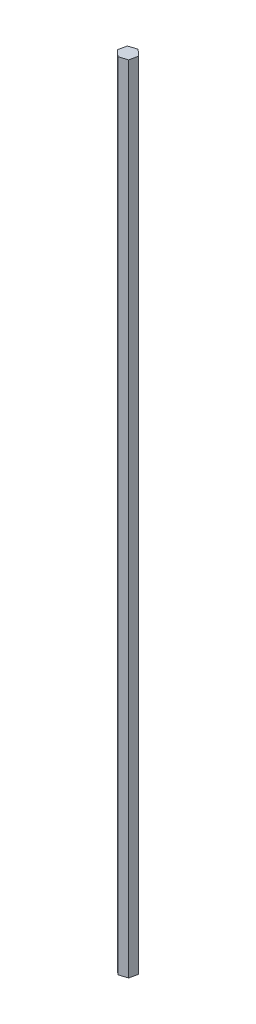
ISO-10303-21;
HEADER;
FILE_DESCRIPTION(('STEP AP214'),'2;1');
FILE_NAME('part.step','',(''),(''),'','','');
FILE_SCHEMA(('AUTOMOTIVE_DESIGN { 1 0 10303 214 1 1 1 1 }'));
ENDSEC;
DATA;
#1=APPLICATION_CONTEXT('core data for automotive mechanical design processes');
#2=APPLICATION_PROTOCOL_DEFINITION('international standard','automotive_design',2000,#1);
#3=PRODUCT_CONTEXT('',#1,'mechanical');
#4=PRODUCT('Part','Part','',(#3));
#5=PRODUCT_RELATED_PRODUCT_CATEGORY('part','',(#4));
#6=PRODUCT_DEFINITION_FORMATION('','',#4);
#7=PRODUCT_DEFINITION_CONTEXT('part definition',#1,'design');
#8=PRODUCT_DEFINITION('design','',#6,#7);
#9=PRODUCT_DEFINITION_SHAPE('','',#8);
#10=(LENGTH_UNIT() NAMED_UNIT(*) SI_UNIT(.MILLI.,.METRE.));
#11=(NAMED_UNIT(*) PLANE_ANGLE_UNIT() SI_UNIT($,.RADIAN.));
#12=(NAMED_UNIT(*) SI_UNIT($,.STERADIAN.) SOLID_ANGLE_UNIT());
#13=UNCERTAINTY_MEASURE_WITH_UNIT(LENGTH_MEASURE(1.E-05),#10,'distance_accuracy_value','');
#14=(GEOMETRIC_REPRESENTATION_CONTEXT(3) GLOBAL_UNCERTAINTY_ASSIGNED_CONTEXT((#13)) GLOBAL_UNIT_ASSIGNED_CONTEXT((#10,
#11,#12)) REPRESENTATION_CONTEXT('',''));
#15=CARTESIAN_POINT('',(0.,0.,0.));
#16=DIRECTION('',(0.,0.,1.));
#17=DIRECTION('',(1.,0.,0.));
#18=AXIS2_PLACEMENT_3D('',#15,#16,#17);
#19=CARTESIAN_POINT('',(-4.89451615472834,685.8,2.61727074902336));
#20=DIRECTION('',(-0.307073653476547,0.,-0.951685752410198));
#21=DIRECTION('',(-0.951685752410198,0.,0.307073653476547));
#22=AXIS2_PLACEMENT_3D('',#19,#20,#21);
#23=PLANE('',#22);
#24=DIRECTION('',(0.951685752410198,0.,-0.307073653476547));
#25=VECTOR('',#24,1.);
#26=CARTESIAN_POINT('',(-4.89451615472834,0.,2.61727074902336));
#27=LINE('',#26,#25);
#28=CARTESIAN_POINT('',(-4.89451615472834,0.,2.61727074902336));
#29=VERTEX_POINT('',#28);
#30=CARTESIAN_POINT('',(2.08357536706375,0.,0.365699731527632));
#31=VERTEX_POINT('',#30);
#32=EDGE_CURVE('E130',#29,#31,#27,.T.);
#33=ORIENTED_EDGE('',*,*,#32,.T.);
#34=DIRECTION('',(0.,-1.,0.));
#35=VECTOR('',#34,1.);
#36=CARTESIAN_POINT('',(2.08357536706375,685.8,0.365699731527632));
#37=LINE('',#36,#35);
#38=CARTESIAN_POINT('',(2.08357536706375,685.8,0.365699731527632));
#39=VERTEX_POINT('',#38);
#40=EDGE_CURVE('E11',#39,#31,#37,.T.);
#41=ORIENTED_EDGE('',*,*,#40,.F.);
#42=DIRECTION('',(0.951685752410198,0.,-0.307073653476547));
#43=VECTOR('',#42,1.);
#44=CARTESIAN_POINT('',(-4.89451615472834,685.8,2.61727074902336));
#45=LINE('',#44,#43);
#46=CARTESIAN_POINT('',(-4.89451615472834,685.8,2.61727074902336));
#47=VERTEX_POINT('',#46);
#48=EDGE_CURVE('E146',#47,#39,#45,.T.);
#49=ORIENTED_EDGE('',*,*,#48,.F.);
#50=DIRECTION('',(0.,-1.,0.));
#51=VECTOR('',#50,1.);
#52=CARTESIAN_POINT('',(-4.89451615472834,685.8,2.61727074902336));
#53=LINE('',#52,#51);
#54=EDGE_CURVE('E126',#47,#29,#53,.T.);
#55=ORIENTED_EDGE('',*,*,#54,.T.);
#56=EDGE_LOOP('',(#33,#41,#49,#55));
#57=FACE_BOUND('',#56,.T.);
#58=ADVANCED_FACE('F41',(#57),#23,.F.);
#59=CARTESIAN_POINT('',(2.08357536706375,685.8,0.365699731527632));
#60=DIRECTION('',(-0.977720864745213,0.,-0.20990929146151));
#61=DIRECTION('',(-0.20990929146151,0.,0.977720864745213));
#62=AXIS2_PLACEMENT_3D('',#59,#60,#61);
#63=PLANE('',#62);
#64=DIRECTION('',(0.20990929146151,0.,-0.977720864745213));
#65=VECTOR('',#64,1.);
#66=CARTESIAN_POINT('',(2.08357536706375,0.,0.365699731527632));
#67=LINE('',#66,#65);
#68=CARTESIAN_POINT('',(3.62270342838372,0.,-6.80329030502499));
#69=VERTEX_POINT('',#68);
#70=EDGE_CURVE('E134',#31,#69,#67,.T.);
#71=ORIENTED_EDGE('',*,*,#70,.T.);
#72=DIRECTION('',(0.,-1.,0.));
#73=VECTOR('',#72,1.);
#74=CARTESIAN_POINT('',(3.62270342838372,685.8,-6.80329030502499));
#75=LINE('',#74,#73);
#76=CARTESIAN_POINT('',(3.62270342838372,685.8,-6.80329030502499));
#77=VERTEX_POINT('',#76);
#78=EDGE_CURVE('E50',#77,#69,#75,.T.);
#79=ORIENTED_EDGE('',*,*,#78,.F.);
#80=DIRECTION('',(0.20990929146151,0.,-0.977720864745213));
#81=VECTOR('',#80,1.);
#82=CARTESIAN_POINT('',(2.08357536706375,685.8,0.365699731527632));
#83=LINE('',#82,#81);
#84=EDGE_CURVE('E95',#39,#77,#83,.T.);
#85=ORIENTED_EDGE('',*,*,#84,.F.);
#86=ORIENTED_EDGE('',*,*,#40,.T.);
#87=EDGE_LOOP('',(#71,#79,#85,#86));
#88=FACE_BOUND('',#87,.T.);
#89=ADVANCED_FACE('F174',(#88),#63,.F.);
#90=CARTESIAN_POINT('',(3.62270342838372,685.8,-6.80329030502499));
#91=DIRECTION('',(-0.670647211268666,0.,0.741776460948689));
#92=DIRECTION('',(0.741776460948689,0.,0.670647211268666));
#93=AXIS2_PLACEMENT_3D('',#90,#91,#92);
#94=PLANE('',#93);
#95=DIRECTION('',(-0.741776460948689,0.,-0.670647211268666));
#96=VECTOR('',#95,1.);
#97=CARTESIAN_POINT('',(3.62270342838372,0.,-6.80329030502499));
#98=LINE('',#97,#96);
#99=CARTESIAN_POINT('',(-1.8162600320884,0.,-11.7207093240819));
#100=VERTEX_POINT('',#99);
#101=EDGE_CURVE('E137',#69,#100,#98,.T.);
#102=ORIENTED_EDGE('',*,*,#101,.T.);
#103=DIRECTION('',(0.,-1.,0.));
#104=VECTOR('',#103,1.);
#105=CARTESIAN_POINT('',(-1.8162600320884,685.8,-11.7207093240819));
#106=LINE('',#105,#104);
#107=CARTESIAN_POINT('',(-1.8162600320884,685.8,-11.7207093240819));
#108=VERTEX_POINT('',#107);
#109=EDGE_CURVE('E119',#108,#100,#106,.T.);
#110=ORIENTED_EDGE('',*,*,#109,.F.);
#111=DIRECTION('',(-0.741776460948689,0.,-0.670647211268666));
#112=VECTOR('',#111,1.);
#113=CARTESIAN_POINT('',(3.62270342838372,685.8,-6.80329030502499));
#114=LINE('',#113,#112);
#115=EDGE_CURVE('E108',#77,#108,#114,.T.);
#116=ORIENTED_EDGE('',*,*,#115,.F.);
#117=ORIENTED_EDGE('',*,*,#78,.T.);
#118=EDGE_LOOP('',(#102,#110,#116,#117));
#119=FACE_BOUND('',#118,.T.);
#120=ADVANCED_FACE('F156',(#119),#94,.F.);
#121=CARTESIAN_POINT('',(-1.8162600320884,685.8,-11.7207093240819));
#122=DIRECTION('',(0.307073653476547,0.,0.951685752410198));
#123=DIRECTION('',(0.951685752410198,0.,-0.307073653476547));
#124=AXIS2_PLACEMENT_3D('',#121,#122,#123);
#125=PLANE('',#124);
#126=DIRECTION('',(-0.951685752410198,0.,0.307073653476547));
#127=VECTOR('',#126,1.);
#128=CARTESIAN_POINT('',(-1.8162600320884,0.,-11.7207093240819));
#129=LINE('',#128,#127);
#130=CARTESIAN_POINT('',(-8.79435155388049,0.,-9.46913830658617));
#131=VERTEX_POINT('',#130);
#132=EDGE_CURVE('E117',#100,#131,#129,.T.);
#133=ORIENTED_EDGE('',*,*,#132,.T.);
#134=DIRECTION('',(0.,-1.,0.));
#135=VECTOR('',#134,1.);
#136=CARTESIAN_POINT('',(-8.79435155388049,685.8,-9.46913830658617));
#137=LINE('',#136,#135);
#138=CARTESIAN_POINT('',(-8.79435155388049,685.8,-9.46913830658617));
#139=VERTEX_POINT('',#138);
#140=EDGE_CURVE('E114',#139,#131,#137,.T.);
#141=ORIENTED_EDGE('',*,*,#140,.F.);
#142=DIRECTION('',(-0.951685752410198,0.,0.307073653476547));
#143=VECTOR('',#142,1.);
#144=CARTESIAN_POINT('',(-1.8162600320884,685.8,-11.7207093240819));
#145=LINE('',#144,#143);
#146=EDGE_CURVE('E102',#108,#139,#145,.T.);
#147=ORIENTED_EDGE('',*,*,#146,.F.);
#148=ORIENTED_EDGE('',*,*,#109,.T.);
#149=EDGE_LOOP('',(#133,#141,#147,#148));
#150=FACE_BOUND('',#149,.T.);
#151=ADVANCED_FACE('F115',(#150),#125,.F.);
#152=CARTESIAN_POINT('',(-8.79435155388049,685.8,-9.46913830658617));
#153=DIRECTION('',(0.977720864745213,0.,0.20990929146151));
#154=DIRECTION('',(0.20990929146151,0.,-0.977720864745213));
#155=AXIS2_PLACEMENT_3D('',#152,#153,#154);
#156=PLANE('',#155);
#157=DIRECTION('',(-0.20990929146151,0.,0.977720864745213));
#158=VECTOR('',#157,1.);
#159=CARTESIAN_POINT('',(-8.79435155388049,0.,-9.46913830658617));
#160=LINE('',#159,#158);
#161=CARTESIAN_POINT('',(-10.3334796152005,0.,-2.30014827003354));
#162=VERTEX_POINT('',#161);
#163=EDGE_CURVE('E81',#131,#162,#160,.T.);
#164=ORIENTED_EDGE('',*,*,#163,.T.);
#165=DIRECTION('',(0.,-1.,0.));
#166=VECTOR('',#165,1.);
#167=CARTESIAN_POINT('',(-10.3334796152005,685.8,-2.30014827003354));
#168=LINE('',#167,#166);
#169=CARTESIAN_POINT('',(-10.3334796152005,685.8,-2.30014827003354));
#170=VERTEX_POINT('',#169);
#171=EDGE_CURVE('E120',#170,#162,#168,.T.);
#172=ORIENTED_EDGE('',*,*,#171,.F.);
#173=DIRECTION('',(-0.20990929146151,0.,0.977720864745213));
#174=VECTOR('',#173,1.);
#175=CARTESIAN_POINT('',(-8.79435155388049,685.8,-9.46913830658617));
#176=LINE('',#175,#174);
#177=EDGE_CURVE('E106',#139,#170,#176,.T.);
#178=ORIENTED_EDGE('',*,*,#177,.F.);
#179=ORIENTED_EDGE('',*,*,#140,.T.);
#180=EDGE_LOOP('',(#164,#172,#178,#179));
#181=FACE_BOUND('',#180,.T.);
#182=ADVANCED_FACE('F122',(#181),#156,.F.);
#183=CARTESIAN_POINT('',(-10.3334796152005,685.8,-2.30014827003354));
#184=DIRECTION('',(0.670647211268666,0.,-0.741776460948688));
#185=DIRECTION('',(-0.741776460948688,0.,-0.670647211268666));
#186=AXIS2_PLACEMENT_3D('',#183,#184,#185);
#187=PLANE('',#186);
#188=DIRECTION('',(0.741776460948688,0.,0.670647211268666));
#189=VECTOR('',#188,1.);
#190=CARTESIAN_POINT('',(-10.3334796152005,0.,-2.30014827003354));
#191=LINE('',#190,#189);
#192=EDGE_CURVE('E87',#162,#29,#191,.T.);
#193=ORIENTED_EDGE('',*,*,#192,.T.);
#194=ORIENTED_EDGE('',*,*,#54,.F.);
#195=DIRECTION('',(0.741776460948688,0.,0.670647211268666));
#196=VECTOR('',#195,1.);
#197=CARTESIAN_POINT('',(-10.3334796152005,685.8,-2.30014827003354));
#198=LINE('',#197,#196);
#199=EDGE_CURVE('E58',#170,#47,#198,.T.);
#200=ORIENTED_EDGE('',*,*,#199,.F.);
#201=ORIENTED_EDGE('',*,*,#171,.T.);
#202=EDGE_LOOP('',(#193,#194,#200,#201));
#203=FACE_BOUND('',#202,.T.);
#204=ADVANCED_FACE('F163',(#203),#187,.F.);
#205=CARTESIAN_POINT('',(0.,685.8,0.));
#206=DIRECTION('',(0.,1.,0.));
#207=DIRECTION('',(0.,0.,1.));
#208=AXIS2_PLACEMENT_3D('',#205,#206,#207);
#209=PLANE('',#208);
#210=ORIENTED_EDGE('',*,*,#48,.T.);
#211=ORIENTED_EDGE('',*,*,#84,.T.);
#212=ORIENTED_EDGE('',*,*,#115,.T.);
#213=ORIENTED_EDGE('',*,*,#146,.T.);
#214=ORIENTED_EDGE('',*,*,#177,.T.);
#215=ORIENTED_EDGE('',*,*,#199,.T.);
#216=EDGE_LOOP('',(#210,#211,#212,#213,#214,#215));
#217=FACE_BOUND('',#216,.T.);
#218=ADVANCED_FACE('F104',(#217),#209,.T.);
#219=CARTESIAN_POINT('',(0.,0.,0.));
#220=DIRECTION('',(0.,1.,0.));
#221=DIRECTION('',(0.,0.,1.));
#222=AXIS2_PLACEMENT_3D('',#219,#220,#221);
#223=PLANE('',#222);
#224=ORIENTED_EDGE('',*,*,#32,.F.);
#225=ORIENTED_EDGE('',*,*,#192,.F.);
#226=ORIENTED_EDGE('',*,*,#163,.F.);
#227=ORIENTED_EDGE('',*,*,#132,.F.);
#228=ORIENTED_EDGE('',*,*,#101,.F.);
#229=ORIENTED_EDGE('',*,*,#70,.F.);
#230=EDGE_LOOP('',(#224,#225,#226,#227,#228,#229));
#231=FACE_BOUND('',#230,.T.);
#232=ADVANCED_FACE('F159',(#231),#223,.F.);
#233=CLOSED_SHELL('',(#58,#89,#120,#151,#182,#204,#218,#232));
#234=MANIFOLD_SOLID_BREP('B2',#233);
#235=ADVANCED_BREP_SHAPE_REPRESENTATION('',(#18,#234),#14);
#236=SHAPE_DEFINITION_REPRESENTATION(#9,#235);
ENDSEC;
END-ISO-10303-21;
